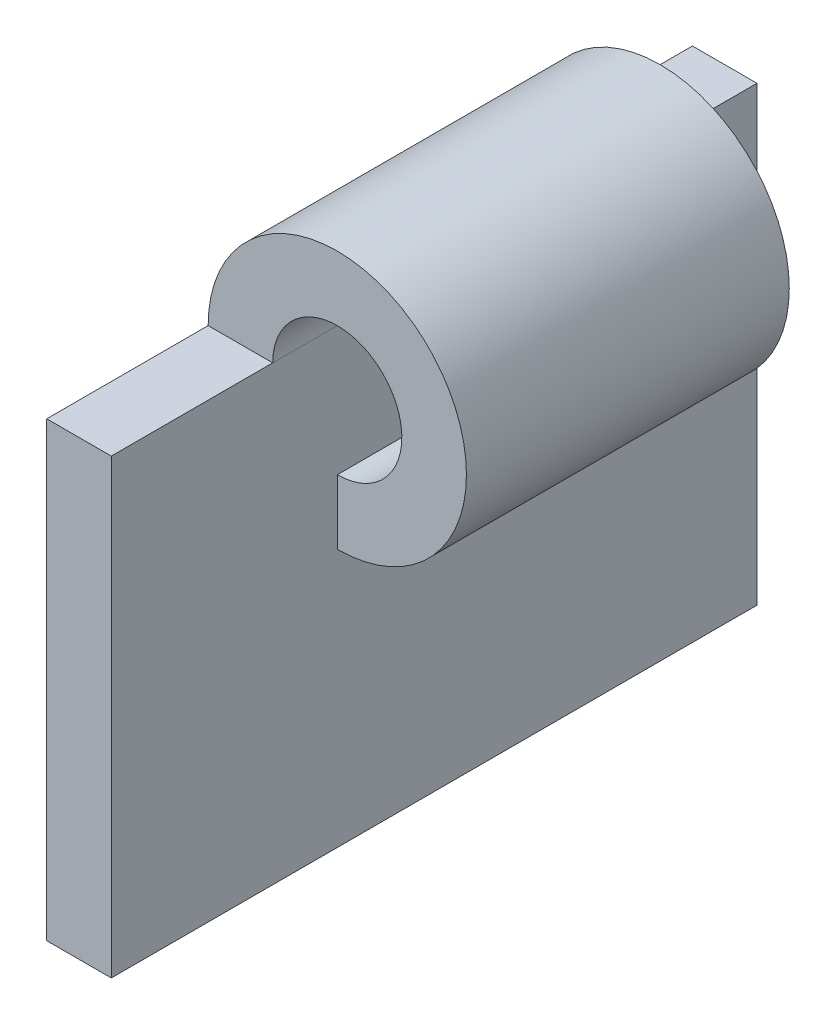
ISO-10303-21;
HEADER;
FILE_DESCRIPTION(('STEP AP214'),'2;1');
FILE_NAME('part.step','',(''),(''),'','','');
FILE_SCHEMA(('AUTOMOTIVE_DESIGN { 1 0 10303 214 1 1 1 1 }'));
ENDSEC;
DATA;
#1=APPLICATION_CONTEXT('core data for automotive mechanical design processes');
#2=APPLICATION_PROTOCOL_DEFINITION('international standard','automotive_design',2000,#1);
#3=PRODUCT_CONTEXT('',#1,'mechanical');
#4=PRODUCT('Part','Part','',(#3));
#5=PRODUCT_RELATED_PRODUCT_CATEGORY('part','',(#4));
#6=PRODUCT_DEFINITION_FORMATION('','',#4);
#7=PRODUCT_DEFINITION_CONTEXT('part definition',#1,'design');
#8=PRODUCT_DEFINITION('design','',#6,#7);
#9=PRODUCT_DEFINITION_SHAPE('','',#8);
#10=(LENGTH_UNIT() NAMED_UNIT(*) SI_UNIT(.MILLI.,.METRE.));
#11=(NAMED_UNIT(*) PLANE_ANGLE_UNIT() SI_UNIT($,.RADIAN.));
#12=(NAMED_UNIT(*) SI_UNIT($,.STERADIAN.) SOLID_ANGLE_UNIT());
#13=UNCERTAINTY_MEASURE_WITH_UNIT(LENGTH_MEASURE(1.E-05),#10,'distance_accuracy_value','');
#14=(GEOMETRIC_REPRESENTATION_CONTEXT(3) GLOBAL_UNCERTAINTY_ASSIGNED_CONTEXT((#13)) GLOBAL_UNIT_ASSIGNED_CONTEXT((#10,
#11,#12)) REPRESENTATION_CONTEXT('',''));
#15=CARTESIAN_POINT('',(0.,0.,0.));
#16=DIRECTION('',(0.,0.,1.));
#17=DIRECTION('',(1.,0.,0.));
#18=AXIS2_PLACEMENT_3D('',#15,#16,#17);
#19=CARTESIAN_POINT('',(4.,14.,15.));
#20=DIRECTION('',(0.,0.,-1.));
#21=DIRECTION('',(-1.,0.,0.));
#22=AXIS2_PLACEMENT_3D('',#19,#20,#21);
#23=CYLINDRICAL_SURFACE('',#22,2.);
#24=CARTESIAN_POINT('',(4.,14.,5.));
#25=DIRECTION('',(0.,0.,1.));
#26=DIRECTION('',(1.,0.,0.));
#27=AXIS2_PLACEMENT_3D('',#24,#25,#26);
#28=CIRCLE('',#27,2.);
#29=CARTESIAN_POINT('',(4.,12.,5.));
#30=VERTEX_POINT('',#29);
#31=CARTESIAN_POINT('',(2.,14.,5.));
#32=VERTEX_POINT('',#31);
#33=EDGE_CURVE('E121',#30,#32,#28,.T.);
#34=ORIENTED_EDGE('',*,*,#33,.F.);
#35=DIRECTION('',(0.,0.,-1.));
#36=VECTOR('',#35,1.);
#37=CARTESIAN_POINT('',(4.,12.,15.));
#38=LINE('',#37,#36);
#39=CARTESIAN_POINT('',(4.,12.,15.));
#40=VERTEX_POINT('',#39);
#41=EDGE_CURVE('E12',#40,#30,#38,.T.);
#42=ORIENTED_EDGE('',*,*,#41,.F.);
#43=CARTESIAN_POINT('',(4.,14.,15.));
#44=DIRECTION('',(0.,0.,1.));
#45=DIRECTION('',(1.,0.,0.));
#46=AXIS2_PLACEMENT_3D('',#43,#44,#45);
#47=CIRCLE('',#46,2.);
#48=CARTESIAN_POINT('',(2.,14.,15.));
#49=VERTEX_POINT('',#48);
#50=EDGE_CURVE('E109',#40,#49,#47,.T.);
#51=ORIENTED_EDGE('',*,*,#50,.T.);
#52=DIRECTION('',(0.,0.,-1.));
#53=VECTOR('',#52,1.);
#54=CARTESIAN_POINT('',(2.,14.,15.));
#55=LINE('',#54,#53);
#56=EDGE_CURVE('E98',#49,#32,#55,.T.);
#57=ORIENTED_EDGE('',*,*,#56,.T.);
#58=EDGE_LOOP('',(#34,#42,#51,#57));
#59=FACE_BOUND('',#58,.T.);
#60=ADVANCED_FACE('F59',(#59),#23,.F.);
#61=CARTESIAN_POINT('',(4.,0.,15.));
#62=DIRECTION('',(1.,0.,0.));
#63=DIRECTION('',(0.,0.,-1.));
#64=AXIS2_PLACEMENT_3D('',#61,#62,#63);
#65=PLANE('',#64);
#66=DIRECTION('',(0.,-1.,0.));
#67=VECTOR('',#66,1.);
#68=CARTESIAN_POINT('',(4.,0.,5.));
#69=LINE('',#68,#67);
#70=CARTESIAN_POINT('',(4.,10.,5.));
#71=VERTEX_POINT('',#70);
#72=EDGE_CURVE('E114',#30,#71,#69,.T.);
#73=ORIENTED_EDGE('',*,*,#72,.T.);
#74=DIRECTION('',(0.,0.,-1.));
#75=VECTOR('',#74,1.);
#76=CARTESIAN_POINT('',(4.,10.,15.));
#77=LINE('',#76,#75);
#78=CARTESIAN_POINT('',(4.,10.,15.));
#79=VERTEX_POINT('',#78);
#80=EDGE_CURVE('E67',#79,#71,#77,.T.);
#81=ORIENTED_EDGE('',*,*,#80,.F.);
#82=DIRECTION('',(0.,-1.,0.));
#83=VECTOR('',#82,1.);
#84=CARTESIAN_POINT('',(4.,0.,15.));
#85=LINE('',#84,#83);
#86=EDGE_CURVE('E104',#40,#79,#85,.T.);
#87=ORIENTED_EDGE('',*,*,#86,.F.);
#88=ORIENTED_EDGE('',*,*,#41,.T.);
#89=EDGE_LOOP('',(#73,#81,#87,#88));
#90=FACE_BOUND('',#89,.T.);
#91=ADVANCED_FACE('F112',(#90),#65,.F.);
#92=CARTESIAN_POINT('',(4.,14.,15.));
#93=DIRECTION('',(0.,0.,-1.));
#94=DIRECTION('',(-1.,0.,0.));
#95=AXIS2_PLACEMENT_3D('',#92,#93,#94);
#96=CYLINDRICAL_SURFACE('',#95,4.);
#97=CARTESIAN_POINT('',(4.,14.,5.));
#98=DIRECTION('',(0.,0.,1.));
#99=DIRECTION('',(1.,0.,0.));
#100=AXIS2_PLACEMENT_3D('',#97,#98,#99);
#101=CIRCLE('',#100,4.);
#102=CARTESIAN_POINT('',(0.,14.,5.));
#103=VERTEX_POINT('',#102);
#104=EDGE_CURVE('E91',#71,#103,#101,.T.);
#105=ORIENTED_EDGE('',*,*,#104,.T.);
#106=DIRECTION('',(0.,0.,-1.));
#107=VECTOR('',#106,1.);
#108=CARTESIAN_POINT('',(0.,14.,15.));
#109=LINE('',#108,#107);
#110=CARTESIAN_POINT('',(0.,14.,15.));
#111=VERTEX_POINT('',#110);
#112=EDGE_CURVE('E115',#111,#103,#109,.T.);
#113=ORIENTED_EDGE('',*,*,#112,.F.);
#114=CARTESIAN_POINT('',(4.,14.,15.));
#115=DIRECTION('',(0.,0.,1.));
#116=DIRECTION('',(1.,0.,0.));
#117=AXIS2_PLACEMENT_3D('',#114,#115,#116);
#118=CIRCLE('',#117,4.);
#119=EDGE_CURVE('E108',#79,#111,#118,.T.);
#120=ORIENTED_EDGE('',*,*,#119,.F.);
#121=ORIENTED_EDGE('',*,*,#80,.T.);
#122=EDGE_LOOP('',(#105,#113,#120,#121));
#123=FACE_BOUND('',#122,.T.);
#124=ADVANCED_FACE('F116',(#123),#96,.T.);
#125=CARTESIAN_POINT('',(0.,14.,15.));
#126=DIRECTION('',(0.,1.,0.));
#127=DIRECTION('',(0.,0.,1.));
#128=AXIS2_PLACEMENT_3D('',#125,#126,#127);
#129=PLANE('',#128);
#130=DIRECTION('',(1.,0.,0.));
#131=VECTOR('',#130,1.);
#132=CARTESIAN_POINT('',(0.,14.,5.));
#133=LINE('',#132,#131);
#134=EDGE_CURVE('E126',#103,#32,#133,.T.);
#135=ORIENTED_EDGE('',*,*,#134,.T.);
#136=ORIENTED_EDGE('',*,*,#56,.F.);
#137=DIRECTION('',(1.,0.,0.));
#138=VECTOR('',#137,1.);
#139=CARTESIAN_POINT('',(0.,14.,15.));
#140=LINE('',#139,#138);
#141=EDGE_CURVE('E75',#111,#49,#140,.T.);
#142=ORIENTED_EDGE('',*,*,#141,.F.);
#143=ORIENTED_EDGE('',*,*,#112,.T.);
#144=EDGE_LOOP('',(#135,#136,#142,#143));
#145=FACE_BOUND('',#144,.T.);
#146=ADVANCED_FACE('F131',(#145),#129,.F.);
#147=CARTESIAN_POINT('',(0.,0.,15.));
#148=DIRECTION('',(0.,0.,1.));
#149=DIRECTION('',(1.,0.,0.));
#150=AXIS2_PLACEMENT_3D('',#147,#148,#149);
#151=PLANE('',#150);
#152=ORIENTED_EDGE('',*,*,#50,.F.);
#153=ORIENTED_EDGE('',*,*,#86,.T.);
#154=ORIENTED_EDGE('',*,*,#119,.T.);
#155=ORIENTED_EDGE('',*,*,#141,.T.);
#156=EDGE_LOOP('',(#152,#153,#154,#155));
#157=FACE_BOUND('',#156,.T.);
#158=ADVANCED_FACE('F106',(#157),#151,.T.);
#159=CARTESIAN_POINT('',(0.,0.,5.));
#160=DIRECTION('',(0.,0.,1.));
#161=DIRECTION('',(1.,0.,0.));
#162=AXIS2_PLACEMENT_3D('',#159,#160,#161);
#163=PLANE('',#162);
#164=ORIENTED_EDGE('',*,*,#33,.T.);
#165=ORIENTED_EDGE('',*,*,#134,.F.);
#166=ORIENTED_EDGE('',*,*,#104,.F.);
#167=ORIENTED_EDGE('',*,*,#72,.F.);
#168=EDGE_LOOP('',(#164,#165,#166,#167));
#169=FACE_BOUND('',#168,.T.);
#170=ADVANCED_FACE('F133',(#169),#163,.F.);
#171=CLOSED_SHELL('',(#60,#91,#124,#146,#158,#170));
#172=MANIFOLD_SOLID_BREP('B2',#171);
#173=CARTESIAN_POINT('',(0.,0.,20.));
#174=DIRECTION('',(0.,-1.,0.));
#175=DIRECTION('',(0.,0.,-1.));
#176=AXIS2_PLACEMENT_3D('',#173,#174,#175);
#177=PLANE('',#176);
#178=DIRECTION('',(-1.,0.,0.));
#179=VECTOR('',#178,1.);
#180=CARTESIAN_POINT('',(0.,0.,0.));
#181=LINE('',#180,#179);
#182=CARTESIAN_POINT('',(2.,0.,0.));
#183=VERTEX_POINT('',#182);
#184=CARTESIAN_POINT('',(0.,0.,0.));
#185=VERTEX_POINT('',#184);
#186=EDGE_CURVE('E251',#183,#185,#181,.T.);
#187=ORIENTED_EDGE('',*,*,#186,.F.);
#188=DIRECTION('',(0.,0.,-1.));
#189=VECTOR('',#188,1.);
#190=CARTESIAN_POINT('',(2.,0.,20.));
#191=LINE('',#190,#189);
#192=CARTESIAN_POINT('',(2.,0.,20.));
#193=VERTEX_POINT('',#192);
#194=EDGE_CURVE('E57',#193,#183,#191,.T.);
#195=ORIENTED_EDGE('',*,*,#194,.F.);
#196=DIRECTION('',(-1.,0.,0.));
#197=VECTOR('',#196,1.);
#198=CARTESIAN_POINT('',(0.,0.,20.));
#199=LINE('',#198,#197);
#200=CARTESIAN_POINT('',(0.,0.,20.));
#201=VERTEX_POINT('',#200);
#202=EDGE_CURVE('E240',#193,#201,#199,.T.);
#203=ORIENTED_EDGE('',*,*,#202,.T.);
#204=DIRECTION('',(0.,0.,-1.));
#205=VECTOR('',#204,1.);
#206=CARTESIAN_POINT('',(0.,0.,20.));
#207=LINE('',#206,#205);
#208=EDGE_CURVE('E200',#201,#185,#207,.T.);
#209=ORIENTED_EDGE('',*,*,#208,.T.);
#210=EDGE_LOOP('',(#187,#195,#203,#209));
#211=FACE_BOUND('',#210,.T.);
#212=ADVANCED_FACE('F183',(#211),#177,.T.);
#213=CARTESIAN_POINT('',(2.,0.,20.));
#214=DIRECTION('',(1.,0.,0.));
#215=DIRECTION('',(0.,0.,-1.));
#216=AXIS2_PLACEMENT_3D('',#213,#214,#215);
#217=PLANE('',#216);
#218=DIRECTION('',(0.,-1.,0.));
#219=VECTOR('',#218,1.);
#220=CARTESIAN_POINT('',(2.,0.,0.));
#221=LINE('',#220,#219);
#222=CARTESIAN_POINT('',(2.,14.,0.));
#223=VERTEX_POINT('',#222);
#224=EDGE_CURVE('E230',#223,#183,#221,.T.);
#225=ORIENTED_EDGE('',*,*,#224,.F.);
#226=DIRECTION('',(0.,0.,-1.));
#227=VECTOR('',#226,1.);
#228=CARTESIAN_POINT('',(2.,14.,20.));
#229=LINE('',#228,#227);
#230=CARTESIAN_POINT('',(2.,14.,20.));
#231=VERTEX_POINT('',#230);
#232=EDGE_CURVE('E192',#231,#223,#229,.T.);
#233=ORIENTED_EDGE('',*,*,#232,.F.);
#234=DIRECTION('',(0.,-1.,0.));
#235=VECTOR('',#234,1.);
#236=CARTESIAN_POINT('',(2.,0.,20.));
#237=LINE('',#236,#235);
#238=EDGE_CURVE('E228',#231,#193,#237,.T.);
#239=ORIENTED_EDGE('',*,*,#238,.T.);
#240=ORIENTED_EDGE('',*,*,#194,.T.);
#241=EDGE_LOOP('',(#225,#233,#239,#240));
#242=FACE_BOUND('',#241,.T.);
#243=ADVANCED_FACE('F227',(#242),#217,.T.);
#244=CARTESIAN_POINT('',(0.,14.,20.));
#245=DIRECTION('',(0.,1.,0.));
#246=DIRECTION('',(0.,0.,1.));
#247=AXIS2_PLACEMENT_3D('',#244,#245,#246);
#248=PLANE('',#247);
#249=DIRECTION('',(1.,0.,0.));
#250=VECTOR('',#249,1.);
#251=CARTESIAN_POINT('',(0.,14.,0.));
#252=LINE('',#251,#250);
#253=CARTESIAN_POINT('',(0.,14.,0.));
#254=VERTEX_POINT('',#253);
#255=EDGE_CURVE('E256',#254,#223,#252,.T.);
#256=ORIENTED_EDGE('',*,*,#255,.F.);
#257=DIRECTION('',(0.,0.,-1.));
#258=VECTOR('',#257,1.);
#259=CARTESIAN_POINT('',(0.,14.,20.));
#260=LINE('',#259,#258);
#261=CARTESIAN_POINT('',(0.,14.,20.));
#262=VERTEX_POINT('',#261);
#263=EDGE_CURVE('E213',#262,#254,#260,.T.);
#264=ORIENTED_EDGE('',*,*,#263,.F.);
#265=DIRECTION('',(1.,0.,0.));
#266=VECTOR('',#265,1.);
#267=CARTESIAN_POINT('',(0.,14.,20.));
#268=LINE('',#267,#266);
#269=EDGE_CURVE('E239',#262,#231,#268,.T.);
#270=ORIENTED_EDGE('',*,*,#269,.T.);
#271=ORIENTED_EDGE('',*,*,#232,.T.);
#272=EDGE_LOOP('',(#256,#264,#270,#271));
#273=FACE_BOUND('',#272,.T.);
#274=ADVANCED_FACE('F243',(#273),#248,.T.);
#275=CARTESIAN_POINT('',(0.,0.,20.));
#276=DIRECTION('',(-1.,0.,0.));
#277=DIRECTION('',(0.,0.,1.));
#278=AXIS2_PLACEMENT_3D('',#275,#276,#277);
#279=PLANE('',#278);
#280=DIRECTION('',(0.,1.,0.));
#281=VECTOR('',#280,1.);
#282=CARTESIAN_POINT('',(0.,0.,0.));
#283=LINE('',#282,#281);
#284=EDGE_CURVE('E259',#185,#254,#283,.T.);
#285=ORIENTED_EDGE('',*,*,#284,.F.);
#286=ORIENTED_EDGE('',*,*,#208,.F.);
#287=DIRECTION('',(0.,1.,0.));
#288=VECTOR('',#287,1.);
#289=CARTESIAN_POINT('',(0.,0.,20.));
#290=LINE('',#289,#288);
#291=EDGE_CURVE('E245',#201,#262,#290,.T.);
#292=ORIENTED_EDGE('',*,*,#291,.T.);
#293=ORIENTED_EDGE('',*,*,#263,.T.);
#294=EDGE_LOOP('',(#285,#286,#292,#293));
#295=FACE_BOUND('',#294,.T.);
#296=ADVANCED_FACE('F268',(#295),#279,.T.);
#297=CARTESIAN_POINT('',(0.,0.,20.));
#298=DIRECTION('',(0.,0.,1.));
#299=DIRECTION('',(1.,0.,0.));
#300=AXIS2_PLACEMENT_3D('',#297,#298,#299);
#301=PLANE('',#300);
#302=ORIENTED_EDGE('',*,*,#202,.F.);
#303=ORIENTED_EDGE('',*,*,#238,.F.);
#304=ORIENTED_EDGE('',*,*,#269,.F.);
#305=ORIENTED_EDGE('',*,*,#291,.F.);
#306=EDGE_LOOP('',(#302,#303,#304,#305));
#307=FACE_BOUND('',#306,.T.);
#308=ADVANCED_FACE('F237',(#307),#301,.T.);
#309=CARTESIAN_POINT('',(0.,0.,0.));
#310=DIRECTION('',(0.,0.,1.));
#311=DIRECTION('',(1.,0.,0.));
#312=AXIS2_PLACEMENT_3D('',#309,#310,#311);
#313=PLANE('',#312);
#314=ORIENTED_EDGE('',*,*,#186,.T.);
#315=ORIENTED_EDGE('',*,*,#284,.T.);
#316=ORIENTED_EDGE('',*,*,#255,.T.);
#317=ORIENTED_EDGE('',*,*,#224,.T.);
#318=EDGE_LOOP('',(#314,#315,#316,#317));
#319=FACE_BOUND('',#318,.T.);
#320=ADVANCED_FACE('F275',(#319),#313,.F.);
#321=CLOSED_SHELL('',(#212,#243,#274,#296,#308,#320));
#322=MANIFOLD_SOLID_BREP('B6',#321);
#323=ADVANCED_BREP_SHAPE_REPRESENTATION('',(#18,#172,#322),#14);
#324=SHAPE_DEFINITION_REPRESENTATION(#9,#323);
ENDSEC;
END-ISO-10303-21;
